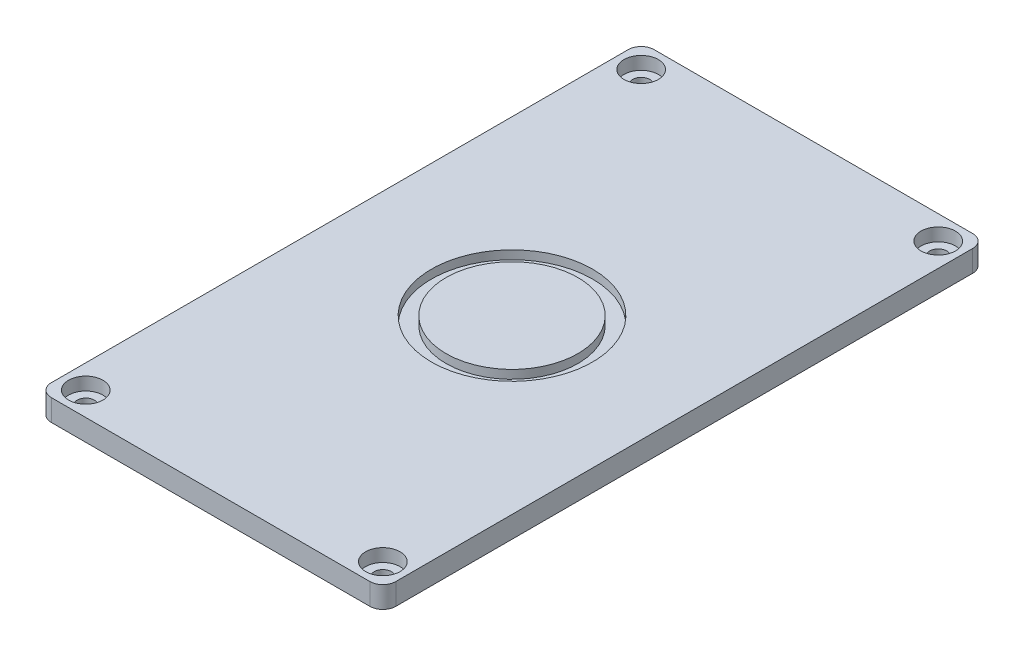
ISO-10303-21;
HEADER;
FILE_DESCRIPTION(('STEP AP214'),'2;1');
FILE_NAME('part.step','',(''),(''),'','','');
FILE_SCHEMA(('AUTOMOTIVE_DESIGN { 1 0 10303 214 1 1 1 1 }'));
ENDSEC;
DATA;
#1=APPLICATION_CONTEXT('core data for automotive mechanical design processes');
#2=APPLICATION_PROTOCOL_DEFINITION('international standard','automotive_design',2000,#1);
#3=PRODUCT_CONTEXT('',#1,'mechanical');
#4=PRODUCT('Part','Part','',(#3));
#5=PRODUCT_RELATED_PRODUCT_CATEGORY('part','',(#4));
#6=PRODUCT_DEFINITION_FORMATION('','',#4);
#7=PRODUCT_DEFINITION_CONTEXT('part definition',#1,'design');
#8=PRODUCT_DEFINITION('design','',#6,#7);
#9=PRODUCT_DEFINITION_SHAPE('','',#8);
#10=(LENGTH_UNIT() NAMED_UNIT(*) SI_UNIT(.MILLI.,.METRE.));
#11=(NAMED_UNIT(*) PLANE_ANGLE_UNIT() SI_UNIT($,.RADIAN.));
#12=(NAMED_UNIT(*) SI_UNIT($,.STERADIAN.) SOLID_ANGLE_UNIT());
#13=UNCERTAINTY_MEASURE_WITH_UNIT(LENGTH_MEASURE(1.E-05),#10,'distance_accuracy_value','');
#14=(GEOMETRIC_REPRESENTATION_CONTEXT(3) GLOBAL_UNCERTAINTY_ASSIGNED_CONTEXT((#13)) GLOBAL_UNIT_ASSIGNED_CONTEXT((#10,
#11,#12)) REPRESENTATION_CONTEXT('',''));
#15=CARTESIAN_POINT('',(0.,0.,0.));
#16=DIRECTION('',(0.,0.,1.));
#17=DIRECTION('',(1.,0.,0.));
#18=AXIS2_PLACEMENT_3D('',#15,#16,#17);
#19=CARTESIAN_POINT('',(0.,5.,0.));
#20=DIRECTION('',(1.,0.,0.));
#21=DIRECTION('',(0.,0.,-1.));
#22=AXIS2_PLACEMENT_3D('',#19,#20,#21);
#23=PLANE('',#22);
#24=DIRECTION('',(0.,0.,1.));
#25=VECTOR('',#24,1.);
#26=CARTESIAN_POINT('',(0.,5.,0.));
#27=LINE('',#26,#25);
#28=CARTESIAN_POINT('',(0.,5.,-137.));
#29=VERTEX_POINT('',#28);
#30=CARTESIAN_POINT('',(0.,5.,-3.));
#31=VERTEX_POINT('',#30);
#32=EDGE_CURVE('E134',#29,#31,#27,.T.);
#33=ORIENTED_EDGE('',*,*,#32,.F.);
#34=DIRECTION('',(0.,-1.,0.));
#35=VECTOR('',#34,1.);
#36=CARTESIAN_POINT('',(0.,5.,-137.));
#37=LINE('',#36,#35);
#38=CARTESIAN_POINT('',(0.,0.,-137.));
#39=VERTEX_POINT('',#38);
#40=EDGE_CURVE('E118',#29,#39,#37,.T.);
#41=ORIENTED_EDGE('',*,*,#40,.T.);
#42=DIRECTION('',(0.,0.,1.));
#43=VECTOR('',#42,1.);
#44=CARTESIAN_POINT('',(0.,0.,0.));
#45=LINE('',#44,#43);
#46=CARTESIAN_POINT('',(0.,0.,-3.));
#47=VERTEX_POINT('',#46);
#48=EDGE_CURVE('E131',#39,#47,#45,.T.);
#49=ORIENTED_EDGE('',*,*,#48,.T.);
#50=DIRECTION('',(0.,-1.,0.));
#51=VECTOR('',#50,1.);
#52=CARTESIAN_POINT('',(0.,5.,-3.));
#53=LINE('',#52,#51);
#54=EDGE_CURVE('E137',#47,#31,#53,.F.);
#55=ORIENTED_EDGE('',*,*,#54,.T.);
#56=EDGE_LOOP('',(#33,#41,#49,#55));
#57=FACE_BOUND('',#56,.T.);
#58=ADVANCED_FACE('F45',(#57),#23,.F.);
#59=CARTESIAN_POINT('',(0.,5.,0.));
#60=DIRECTION('',(0.,0.,-1.));
#61=DIRECTION('',(-1.,0.,0.));
#62=AXIS2_PLACEMENT_3D('',#59,#60,#61);
#63=PLANE('',#62);
#64=DIRECTION('',(1.,0.,0.));
#65=VECTOR('',#64,1.);
#66=CARTESIAN_POINT('',(0.,0.,0.));
#67=LINE('',#66,#65);
#68=CARTESIAN_POINT('',(3.,0.,0.));
#69=VERTEX_POINT('',#68);
#70=CARTESIAN_POINT('',(77.,0.,0.));
#71=VERTEX_POINT('',#70);
#72=EDGE_CURVE('E142',#69,#71,#67,.T.);
#73=ORIENTED_EDGE('',*,*,#72,.T.);
#74=DIRECTION('',(0.,-1.,0.));
#75=VECTOR('',#74,1.);
#76=CARTESIAN_POINT('',(77.,5.,0.));
#77=LINE('',#76,#75);
#78=CARTESIAN_POINT('',(77.,5.,0.));
#79=VERTEX_POINT('',#78);
#80=EDGE_CURVE('E11',#71,#79,#77,.F.);
#81=ORIENTED_EDGE('',*,*,#80,.T.);
#82=DIRECTION('',(1.,0.,0.));
#83=VECTOR('',#82,1.);
#84=CARTESIAN_POINT('',(0.,5.,0.));
#85=LINE('',#84,#83);
#86=CARTESIAN_POINT('',(3.,5.,0.));
#87=VERTEX_POINT('',#86);
#88=EDGE_CURVE('E232',#87,#79,#85,.T.);
#89=ORIENTED_EDGE('',*,*,#88,.F.);
#90=DIRECTION('',(0.,-1.,0.));
#91=VECTOR('',#90,1.);
#92=CARTESIAN_POINT('',(3.,5.,0.));
#93=LINE('',#92,#91);
#94=EDGE_CURVE('E55',#87,#69,#93,.T.);
#95=ORIENTED_EDGE('',*,*,#94,.T.);
#96=EDGE_LOOP('',(#73,#81,#89,#95));
#97=FACE_BOUND('',#96,.T.);
#98=ADVANCED_FACE('F253',(#97),#63,.F.);
#99=CARTESIAN_POINT('',(80.,5.,0.));
#100=DIRECTION('',(-1.,0.,0.));
#101=DIRECTION('',(0.,0.,1.));
#102=AXIS2_PLACEMENT_3D('',#99,#100,#101);
#103=PLANE('',#102);
#104=DIRECTION('',(0.,0.,-1.));
#105=VECTOR('',#104,1.);
#106=CARTESIAN_POINT('',(80.,0.,0.));
#107=LINE('',#106,#105);
#108=CARTESIAN_POINT('',(80.,0.,-3.));
#109=VERTEX_POINT('',#108);
#110=CARTESIAN_POINT('',(80.,0.,-137.));
#111=VERTEX_POINT('',#110);
#112=EDGE_CURVE('E148',#109,#111,#107,.T.);
#113=ORIENTED_EDGE('',*,*,#112,.T.);
#114=DIRECTION('',(0.,-1.,0.));
#115=VECTOR('',#114,1.);
#116=CARTESIAN_POINT('',(80.,5.,-137.));
#117=LINE('',#116,#115);
#118=CARTESIAN_POINT('',(80.,5.,-137.));
#119=VERTEX_POINT('',#118);
#120=EDGE_CURVE('E63',#111,#119,#117,.F.);
#121=ORIENTED_EDGE('',*,*,#120,.T.);
#122=DIRECTION('',(0.,0.,-1.));
#123=VECTOR('',#122,1.);
#124=CARTESIAN_POINT('',(80.,5.,0.));
#125=LINE('',#124,#123);
#126=CARTESIAN_POINT('',(80.,5.,-3.));
#127=VERTEX_POINT('',#126);
#128=EDGE_CURVE('E234',#127,#119,#125,.T.);
#129=ORIENTED_EDGE('',*,*,#128,.F.);
#130=DIRECTION('',(0.,-1.,0.));
#131=VECTOR('',#130,1.);
#132=CARTESIAN_POINT('',(80.,5.,-3.));
#133=LINE('',#132,#131);
#134=EDGE_CURVE('E187',#127,#109,#133,.T.);
#135=ORIENTED_EDGE('',*,*,#134,.T.);
#136=EDGE_LOOP('',(#113,#121,#129,#135));
#137=FACE_BOUND('',#136,.T.);
#138=ADVANCED_FACE('F247',(#137),#103,.F.);
#139=CARTESIAN_POINT('',(0.,5.,-140.));
#140=DIRECTION('',(0.,0.,1.));
#141=DIRECTION('',(1.,0.,0.));
#142=AXIS2_PLACEMENT_3D('',#139,#140,#141);
#143=PLANE('',#142);
#144=DIRECTION('',(-1.,0.,0.));
#145=VECTOR('',#144,1.);
#146=CARTESIAN_POINT('',(0.,0.,-140.));
#147=LINE('',#146,#145);
#148=CARTESIAN_POINT('',(77.,0.,-140.));
#149=VERTEX_POINT('',#148);
#150=CARTESIAN_POINT('',(3.,0.,-140.));
#151=VERTEX_POINT('',#150);
#152=EDGE_CURVE('E159',#149,#151,#147,.T.);
#153=ORIENTED_EDGE('',*,*,#152,.T.);
#154=DIRECTION('',(0.,-1.,0.));
#155=VECTOR('',#154,1.);
#156=CARTESIAN_POINT('',(3.,5.,-140.));
#157=LINE('',#156,#155);
#158=CARTESIAN_POINT('',(3.,5.,-140.));
#159=VERTEX_POINT('',#158);
#160=EDGE_CURVE('E119',#151,#159,#157,.F.);
#161=ORIENTED_EDGE('',*,*,#160,.T.);
#162=DIRECTION('',(-1.,0.,0.));
#163=VECTOR('',#162,1.);
#164=CARTESIAN_POINT('',(0.,5.,-140.));
#165=LINE('',#164,#163);
#166=CARTESIAN_POINT('',(77.,5.,-140.));
#167=VERTEX_POINT('',#166);
#168=EDGE_CURVE('E154',#167,#159,#165,.T.);
#169=ORIENTED_EDGE('',*,*,#168,.F.);
#170=DIRECTION('',(0.,-1.,0.));
#171=VECTOR('',#170,1.);
#172=CARTESIAN_POINT('',(77.,5.,-140.));
#173=LINE('',#172,#171);
#174=EDGE_CURVE('E125',#167,#149,#173,.T.);
#175=ORIENTED_EDGE('',*,*,#174,.T.);
#176=EDGE_LOOP('',(#153,#161,#169,#175));
#177=FACE_BOUND('',#176,.T.);
#178=ADVANCED_FACE('F243',(#177),#143,.F.);
#179=CARTESIAN_POINT('',(0.,5.,0.));
#180=DIRECTION('',(0.,-1.,0.));
#181=DIRECTION('',(0.,0.,-1.));
#182=AXIS2_PLACEMENT_3D('',#179,#180,#181);
#183=PLANE('',#182);
#184=CARTESIAN_POINT('',(40.,5.,-70.));
#185=DIRECTION('',(0.,1.,0.));
#186=DIRECTION('',(0.,0.,1.));
#187=AXIS2_PLACEMENT_3D('',#184,#185,#186);
#188=CIRCLE('',#187,18.7073249928219);
#189=CARTESIAN_POINT('',(40.,5.,-51.2926750071781));
#190=VERTEX_POINT('',#189);
#191=EDGE_CURVE('E547',#190,#190,#188,.T.);
#192=ORIENTED_EDGE('',*,*,#191,.F.);
#193=EDGE_LOOP('',(#192));
#194=FACE_BOUND('',#193,.T.);
#195=CARTESIAN_POINT('',(5.5,5.,-134.5));
#196=DIRECTION('',(0.,1.,0.));
#197=DIRECTION('',(0.,0.,-1.));
#198=AXIS2_PLACEMENT_3D('',#195,#196,#197);
#199=CIRCLE('',#198,4.);
#200=CARTESIAN_POINT('',(5.5,5.,-138.5));
#201=VERTEX_POINT('',#200);
#202=EDGE_CURVE('E216',#201,#201,#199,.T.);
#203=ORIENTED_EDGE('',*,*,#202,.F.);
#204=EDGE_LOOP('',(#203));
#205=FACE_BOUND('',#204,.T.);
#206=CARTESIAN_POINT('',(74.5,5.,-134.5));
#207=DIRECTION('',(0.,1.,0.));
#208=DIRECTION('',(0.,0.,1.));
#209=AXIS2_PLACEMENT_3D('',#206,#207,#208);
#210=CIRCLE('',#209,4.00000000000001);
#211=CARTESIAN_POINT('',(74.5,5.,-130.5));
#212=VERTEX_POINT('',#211);
#213=EDGE_CURVE('E521',#212,#212,#210,.T.);
#214=ORIENTED_EDGE('',*,*,#213,.F.);
#215=EDGE_LOOP('',(#214));
#216=FACE_BOUND('',#215,.T.);
#217=CARTESIAN_POINT('',(74.5,5.,-5.50000000000001));
#218=DIRECTION('',(0.,1.,0.));
#219=DIRECTION('',(0.,0.,-1.));
#220=AXIS2_PLACEMENT_3D('',#217,#218,#219);
#221=CIRCLE('',#220,4.00000000000001);
#222=CARTESIAN_POINT('',(74.5,5.,-9.50000000000001));
#223=VERTEX_POINT('',#222);
#224=EDGE_CURVE('E229',#223,#223,#221,.T.);
#225=ORIENTED_EDGE('',*,*,#224,.F.);
#226=EDGE_LOOP('',(#225));
#227=FACE_BOUND('',#226,.T.);
#228=CARTESIAN_POINT('',(5.5,5.,-5.50000000000001));
#229=DIRECTION('',(0.,1.,0.));
#230=DIRECTION('',(0.,0.,1.));
#231=AXIS2_PLACEMENT_3D('',#228,#229,#230);
#232=CIRCLE('',#231,4.);
#233=CARTESIAN_POINT('',(5.5,5.,-1.5));
#234=VERTEX_POINT('',#233);
#235=EDGE_CURVE('E151',#234,#234,#232,.T.);
#236=ORIENTED_EDGE('',*,*,#235,.F.);
#237=EDGE_LOOP('',(#236));
#238=FACE_BOUND('',#237,.T.);
#239=ORIENTED_EDGE('',*,*,#168,.T.);
#240=CARTESIAN_POINT('',(3.,5.,-137.));
#241=DIRECTION('',(0.,-1.,0.));
#242=DIRECTION('',(0.,0.,-1.));
#243=AXIS2_PLACEMENT_3D('',#240,#241,#242);
#244=CIRCLE('',#243,3.);
#245=EDGE_CURVE('E184',#159,#29,#244,.F.);
#246=ORIENTED_EDGE('',*,*,#245,.T.);
#247=ORIENTED_EDGE('',*,*,#32,.T.);
#248=CARTESIAN_POINT('',(3.,5.,-3.));
#249=DIRECTION('',(0.,-1.,0.));
#250=DIRECTION('',(0.,0.,-1.));
#251=AXIS2_PLACEMENT_3D('',#248,#249,#250);
#252=CIRCLE('',#251,3.);
#253=EDGE_CURVE('E176',#31,#87,#252,.F.);
#254=ORIENTED_EDGE('',*,*,#253,.T.);
#255=ORIENTED_EDGE('',*,*,#88,.T.);
#256=CARTESIAN_POINT('',(77.,5.,-3.));
#257=DIRECTION('',(0.,-1.,0.));
#258=DIRECTION('',(0.,0.,-1.));
#259=AXIS2_PLACEMENT_3D('',#256,#257,#258);
#260=CIRCLE('',#259,3.);
#261=EDGE_CURVE('E70',#79,#127,#260,.F.);
#262=ORIENTED_EDGE('',*,*,#261,.T.);
#263=ORIENTED_EDGE('',*,*,#128,.T.);
#264=CARTESIAN_POINT('',(77.,5.,-137.));
#265=DIRECTION('',(0.,-1.,0.));
#266=DIRECTION('',(0.,0.,-1.));
#267=AXIS2_PLACEMENT_3D('',#264,#265,#266);
#268=CIRCLE('',#267,3.);
#269=EDGE_CURVE('E181',#119,#167,#268,.F.);
#270=ORIENTED_EDGE('',*,*,#269,.T.);
#271=EDGE_LOOP('',(#239,#246,#247,#254,#255,#262,#263,#270));
#272=FACE_BOUND('',#271,.T.);
#273=ADVANCED_FACE('F240',(#194,#205,#216,#227,#238,#272),#183,.F.);
#274=CARTESIAN_POINT('',(0.,0.,0.));
#275=DIRECTION('',(0.,-1.,0.));
#276=DIRECTION('',(0.,0.,-1.));
#277=AXIS2_PLACEMENT_3D('',#274,#275,#276);
#278=PLANE('',#277);
#279=CARTESIAN_POINT('',(5.5,0.,-134.5));
#280=DIRECTION('',(0.,-1.,0.));
#281=DIRECTION('',(0.,0.,-1.));
#282=AXIS2_PLACEMENT_3D('',#279,#280,#281);
#283=CIRCLE('',#282,2.);
#284=CARTESIAN_POINT('',(5.5,0.,-136.5));
#285=VERTEX_POINT('',#284);
#286=EDGE_CURVE('E49',#285,#285,#283,.T.);
#287=ORIENTED_EDGE('',*,*,#286,.F.);
#288=EDGE_LOOP('',(#287));
#289=FACE_BOUND('',#288,.T.);
#290=CARTESIAN_POINT('',(74.5,0.,-5.50000000000001));
#291=DIRECTION('',(0.,-1.,0.));
#292=DIRECTION('',(0.,0.,-1.));
#293=AXIS2_PLACEMENT_3D('',#290,#291,#292);
#294=CIRCLE('',#293,2.00000000000001);
#295=CARTESIAN_POINT('',(74.5,0.,-7.50000000000001));
#296=VERTEX_POINT('',#295);
#297=EDGE_CURVE('E204',#296,#296,#294,.T.);
#298=ORIENTED_EDGE('',*,*,#297,.F.);
#299=EDGE_LOOP('',(#298));
#300=FACE_BOUND('',#299,.T.);
#301=CARTESIAN_POINT('',(74.5,0.,-134.5));
#302=DIRECTION('',(0.,-1.,0.));
#303=DIRECTION('',(0.,0.,-1.));
#304=AXIS2_PLACEMENT_3D('',#301,#302,#303);
#305=CIRCLE('',#304,1.99999999999998);
#306=CARTESIAN_POINT('',(74.5,0.,-136.5));
#307=VERTEX_POINT('',#306);
#308=EDGE_CURVE('E200',#307,#307,#305,.T.);
#309=ORIENTED_EDGE('',*,*,#308,.F.);
#310=EDGE_LOOP('',(#309));
#311=FACE_BOUND('',#310,.T.);
#312=CARTESIAN_POINT('',(5.5,0.,-5.50000000000001));
#313=DIRECTION('',(0.,-1.,0.));
#314=DIRECTION('',(0.,0.,-1.));
#315=AXIS2_PLACEMENT_3D('',#312,#313,#314);
#316=CIRCLE('',#315,2.);
#317=CARTESIAN_POINT('',(5.5,0.,-7.50000000000001));
#318=VERTEX_POINT('',#317);
#319=EDGE_CURVE('E196',#318,#318,#316,.T.);
#320=ORIENTED_EDGE('',*,*,#319,.F.);
#321=EDGE_LOOP('',(#320));
#322=FACE_BOUND('',#321,.T.);
#323=ORIENTED_EDGE('',*,*,#48,.F.);
#324=CARTESIAN_POINT('',(3.,0.,-137.));
#325=DIRECTION('',(0.,-1.,0.));
#326=DIRECTION('',(0.,0.,-1.));
#327=AXIS2_PLACEMENT_3D('',#324,#325,#326);
#328=CIRCLE('',#327,3.);
#329=EDGE_CURVE('E114',#39,#151,#328,.T.);
#330=ORIENTED_EDGE('',*,*,#329,.T.);
#331=ORIENTED_EDGE('',*,*,#152,.F.);
#332=CARTESIAN_POINT('',(77.,0.,-137.));
#333=DIRECTION('',(0.,-1.,0.));
#334=DIRECTION('',(0.,0.,-1.));
#335=AXIS2_PLACEMENT_3D('',#332,#333,#334);
#336=CIRCLE('',#335,3.);
#337=EDGE_CURVE('E126',#149,#111,#336,.T.);
#338=ORIENTED_EDGE('',*,*,#337,.T.);
#339=ORIENTED_EDGE('',*,*,#112,.F.);
#340=CARTESIAN_POINT('',(77.,0.,-3.));
#341=DIRECTION('',(0.,-1.,0.));
#342=DIRECTION('',(0.,0.,-1.));
#343=AXIS2_PLACEMENT_3D('',#340,#341,#342);
#344=CIRCLE('',#343,3.);
#345=EDGE_CURVE('E166',#109,#71,#344,.T.);
#346=ORIENTED_EDGE('',*,*,#345,.T.);
#347=ORIENTED_EDGE('',*,*,#72,.F.);
#348=CARTESIAN_POINT('',(3.,0.,-3.));
#349=DIRECTION('',(0.,-1.,0.));
#350=DIRECTION('',(0.,0.,-1.));
#351=AXIS2_PLACEMENT_3D('',#348,#349,#350);
#352=CIRCLE('',#351,3.);
#353=EDGE_CURVE('E136',#69,#47,#352,.T.);
#354=ORIENTED_EDGE('',*,*,#353,.T.);
#355=EDGE_LOOP('',(#323,#330,#331,#338,#339,#346,#347,#354));
#356=FACE_BOUND('',#355,.T.);
#357=ADVANCED_FACE('F139',(#289,#300,#311,#322,#356),#278,.T.);
#358=CARTESIAN_POINT('',(3.,5.,-137.));
#359=DIRECTION('',(0.,-1.,0.));
#360=DIRECTION('',(0.,0.,-1.));
#361=AXIS2_PLACEMENT_3D('',#358,#359,#360);
#362=CYLINDRICAL_SURFACE('',#361,3.);
#363=ORIENTED_EDGE('',*,*,#245,.F.);
#364=ORIENTED_EDGE('',*,*,#160,.F.);
#365=ORIENTED_EDGE('',*,*,#329,.F.);
#366=ORIENTED_EDGE('',*,*,#40,.F.);
#367=EDGE_LOOP('',(#363,#364,#365,#366));
#368=FACE_BOUND('',#367,.T.);
#369=ADVANCED_FACE('F117',(#368),#362,.T.);
#370=CARTESIAN_POINT('',(77.,5.,-137.));
#371=DIRECTION('',(0.,-1.,0.));
#372=DIRECTION('',(0.,0.,-1.));
#373=AXIS2_PLACEMENT_3D('',#370,#371,#372);
#374=CYLINDRICAL_SURFACE('',#373,3.);
#375=ORIENTED_EDGE('',*,*,#269,.F.);
#376=ORIENTED_EDGE('',*,*,#120,.F.);
#377=ORIENTED_EDGE('',*,*,#337,.F.);
#378=ORIENTED_EDGE('',*,*,#174,.F.);
#379=EDGE_LOOP('',(#375,#376,#377,#378));
#380=FACE_BOUND('',#379,.T.);
#381=ADVANCED_FACE('F245',(#380),#374,.T.);
#382=CARTESIAN_POINT('',(77.,5.,-3.));
#383=DIRECTION('',(0.,-1.,0.));
#384=DIRECTION('',(0.,0.,-1.));
#385=AXIS2_PLACEMENT_3D('',#382,#383,#384);
#386=CYLINDRICAL_SURFACE('',#385,3.);
#387=ORIENTED_EDGE('',*,*,#261,.F.);
#388=ORIENTED_EDGE('',*,*,#80,.F.);
#389=ORIENTED_EDGE('',*,*,#345,.F.);
#390=ORIENTED_EDGE('',*,*,#134,.F.);
#391=EDGE_LOOP('',(#387,#388,#389,#390));
#392=FACE_BOUND('',#391,.T.);
#393=ADVANCED_FACE('F250',(#392),#386,.T.);
#394=CARTESIAN_POINT('',(3.,5.,-3.));
#395=DIRECTION('',(0.,-1.,0.));
#396=DIRECTION('',(0.,0.,-1.));
#397=AXIS2_PLACEMENT_3D('',#394,#395,#396);
#398=CYLINDRICAL_SURFACE('',#397,3.);
#399=ORIENTED_EDGE('',*,*,#253,.F.);
#400=ORIENTED_EDGE('',*,*,#54,.F.);
#401=ORIENTED_EDGE('',*,*,#353,.F.);
#402=ORIENTED_EDGE('',*,*,#94,.F.);
#403=EDGE_LOOP('',(#399,#400,#401,#402));
#404=FACE_BOUND('',#403,.T.);
#405=ADVANCED_FACE('F47',(#404),#398,.T.);
#406=CARTESIAN_POINT('',(5.5,2.,-5.50000000000001));
#407=DIRECTION('',(0.,1.,0.));
#408=DIRECTION('',(0.,0.,1.));
#409=AXIS2_PLACEMENT_3D('',#406,#407,#408);
#410=CYLINDRICAL_SURFACE('',#409,4.);
#411=CARTESIAN_POINT('',(5.5,2.,-5.50000000000001));
#412=DIRECTION('',(0.,1.,0.));
#413=DIRECTION('',(0.,0.,1.));
#414=AXIS2_PLACEMENT_3D('',#411,#412,#413);
#415=CIRCLE('',#414,4.);
#416=CARTESIAN_POINT('',(5.5,2.,-1.5));
#417=VERTEX_POINT('',#416);
#418=EDGE_CURVE('E143',#417,#417,#415,.T.);
#419=ORIENTED_EDGE('',*,*,#418,.F.);
#420=EDGE_LOOP('',(#419));
#421=FACE_BOUND('',#420,.T.);
#422=ORIENTED_EDGE('',*,*,#235,.T.);
#423=EDGE_LOOP('',(#422));
#424=FACE_BOUND('',#423,.T.);
#425=ADVANCED_FACE('F259',(#421,#424),#410,.F.);
#426=CARTESIAN_POINT('',(5.5,2.,-5.50000000000001));
#427=DIRECTION('',(0.,1.,0.));
#428=DIRECTION('',(0.,0.,1.));
#429=AXIS2_PLACEMENT_3D('',#426,#427,#428);
#430=PLANE('',#429);
#431=CARTESIAN_POINT('',(5.5,2.,-5.50000000000001));
#432=DIRECTION('',(0.,1.,0.));
#433=DIRECTION('',(0.,0.,1.));
#434=AXIS2_PLACEMENT_3D('',#431,#432,#433);
#435=CIRCLE('',#434,2.);
#436=CARTESIAN_POINT('',(5.5,2.,-3.5));
#437=VERTEX_POINT('',#436);
#438=EDGE_CURVE('E201',#437,#437,#435,.T.);
#439=ORIENTED_EDGE('',*,*,#438,.F.);
#440=EDGE_LOOP('',(#439));
#441=FACE_BOUND('',#440,.T.);
#442=ORIENTED_EDGE('',*,*,#418,.T.);
#443=EDGE_LOOP('',(#442));
#444=FACE_BOUND('',#443,.T.);
#445=ADVANCED_FACE('F264',(#441,#444),#430,.T.);
#446=CARTESIAN_POINT('',(74.5,2.,-5.50000000000001));
#447=DIRECTION('',(0.,1.,0.));
#448=DIRECTION('',(0.,0.,1.));
#449=AXIS2_PLACEMENT_3D('',#446,#447,#448);
#450=CYLINDRICAL_SURFACE('',#449,4.00000000000001);
#451=CARTESIAN_POINT('',(74.5,2.,-5.50000000000001));
#452=DIRECTION('',(0.,1.,0.));
#453=DIRECTION('',(0.,0.,-1.));
#454=AXIS2_PLACEMENT_3D('',#451,#452,#453);
#455=CIRCLE('',#454,4.00000000000001);
#456=CARTESIAN_POINT('',(74.5,2.,-9.50000000000001));
#457=VERTEX_POINT('',#456);
#458=EDGE_CURVE('E517',#457,#457,#455,.T.);
#459=ORIENTED_EDGE('',*,*,#458,.F.);
#460=EDGE_LOOP('',(#459));
#461=FACE_BOUND('',#460,.T.);
#462=ORIENTED_EDGE('',*,*,#224,.T.);
#463=EDGE_LOOP('',(#462));
#464=FACE_BOUND('',#463,.T.);
#465=ADVANCED_FACE('F309',(#461,#464),#450,.F.);
#466=CARTESIAN_POINT('',(74.5,2.,-5.50000000000001));
#467=DIRECTION('',(0.,-1.,0.));
#468=DIRECTION('',(0.,0.,-1.));
#469=AXIS2_PLACEMENT_3D('',#466,#467,#468);
#470=PLANE('',#469);
#471=CARTESIAN_POINT('',(74.5,2.,-5.50000000000001));
#472=DIRECTION('',(0.,1.,0.));
#473=DIRECTION('',(0.,0.,-1.));
#474=AXIS2_PLACEMENT_3D('',#471,#472,#473);
#475=CIRCLE('',#474,2.00000000000001);
#476=CARTESIAN_POINT('',(74.5,2.,-7.50000000000001));
#477=VERTEX_POINT('',#476);
#478=EDGE_CURVE('E510',#477,#477,#475,.T.);
#479=ORIENTED_EDGE('',*,*,#478,.F.);
#480=EDGE_LOOP('',(#479));
#481=FACE_BOUND('',#480,.T.);
#482=ORIENTED_EDGE('',*,*,#458,.T.);
#483=EDGE_LOOP('',(#482));
#484=FACE_BOUND('',#483,.T.);
#485=ADVANCED_FACE('F320',(#481,#484),#470,.F.);
#486=CARTESIAN_POINT('',(74.5,2.,-134.5));
#487=DIRECTION('',(0.,1.,0.));
#488=DIRECTION('',(0.,0.,1.));
#489=AXIS2_PLACEMENT_3D('',#486,#487,#488);
#490=CYLINDRICAL_SURFACE('',#489,4.00000000000001);
#491=CARTESIAN_POINT('',(74.5,2.,-134.5));
#492=DIRECTION('',(0.,1.,0.));
#493=DIRECTION('',(0.,0.,1.));
#494=AXIS2_PLACEMENT_3D('',#491,#492,#493);
#495=CIRCLE('',#494,4.00000000000001);
#496=CARTESIAN_POINT('',(74.5,2.,-130.5));
#497=VERTEX_POINT('',#496);
#498=EDGE_CURVE('E222',#497,#497,#495,.T.);
#499=ORIENTED_EDGE('',*,*,#498,.F.);
#500=EDGE_LOOP('',(#499));
#501=FACE_BOUND('',#500,.T.);
#502=ORIENTED_EDGE('',*,*,#213,.T.);
#503=EDGE_LOOP('',(#502));
#504=FACE_BOUND('',#503,.T.);
#505=ADVANCED_FACE('F330',(#501,#504),#490,.F.);
#506=CARTESIAN_POINT('',(74.5,2.,-134.5));
#507=DIRECTION('',(0.,1.,0.));
#508=DIRECTION('',(0.,0.,1.));
#509=AXIS2_PLACEMENT_3D('',#506,#507,#508);
#510=PLANE('',#509);
#511=CARTESIAN_POINT('',(74.5,2.,-134.5));
#512=DIRECTION('',(0.,1.,0.));
#513=DIRECTION('',(0.,0.,1.));
#514=AXIS2_PLACEMENT_3D('',#511,#512,#513);
#515=CIRCLE('',#514,1.99999999999998);
#516=CARTESIAN_POINT('',(74.5,2.,-132.5));
#517=VERTEX_POINT('',#516);
#518=EDGE_CURVE('E541',#517,#517,#515,.T.);
#519=ORIENTED_EDGE('',*,*,#518,.F.);
#520=EDGE_LOOP('',(#519));
#521=FACE_BOUND('',#520,.T.);
#522=ORIENTED_EDGE('',*,*,#498,.T.);
#523=EDGE_LOOP('',(#522));
#524=FACE_BOUND('',#523,.T.);
#525=ADVANCED_FACE('F340',(#521,#524),#510,.T.);
#526=CARTESIAN_POINT('',(5.5,2.,-134.5));
#527=DIRECTION('',(0.,1.,0.));
#528=DIRECTION('',(0.,0.,1.));
#529=AXIS2_PLACEMENT_3D('',#526,#527,#528);
#530=CYLINDRICAL_SURFACE('',#529,4.);
#531=CARTESIAN_POINT('',(5.5,2.,-134.5));
#532=DIRECTION('',(0.,1.,0.));
#533=DIRECTION('',(0.,0.,-1.));
#534=AXIS2_PLACEMENT_3D('',#531,#532,#533);
#535=CIRCLE('',#534,4.);
#536=CARTESIAN_POINT('',(5.5,2.,-138.5));
#537=VERTEX_POINT('',#536);
#538=EDGE_CURVE('E211',#537,#537,#535,.T.);
#539=ORIENTED_EDGE('',*,*,#538,.F.);
#540=EDGE_LOOP('',(#539));
#541=FACE_BOUND('',#540,.T.);
#542=ORIENTED_EDGE('',*,*,#202,.T.);
#543=EDGE_LOOP('',(#542));
#544=FACE_BOUND('',#543,.T.);
#545=ADVANCED_FACE('F350',(#541,#544),#530,.F.);
#546=CARTESIAN_POINT('',(5.5,2.,-134.5));
#547=DIRECTION('',(0.,-1.,0.));
#548=DIRECTION('',(0.,0.,-1.));
#549=AXIS2_PLACEMENT_3D('',#546,#547,#548);
#550=PLANE('',#549);
#551=CARTESIAN_POINT('',(5.5,2.,-134.5));
#552=DIRECTION('',(0.,1.,0.));
#553=DIRECTION('',(0.,0.,-1.));
#554=AXIS2_PLACEMENT_3D('',#551,#552,#553);
#555=CIRCLE('',#554,2.);
#556=CARTESIAN_POINT('',(5.5,2.,-136.5));
#557=VERTEX_POINT('',#556);
#558=EDGE_CURVE('E506',#557,#557,#555,.T.);
#559=ORIENTED_EDGE('',*,*,#558,.F.);
#560=EDGE_LOOP('',(#559));
#561=FACE_BOUND('',#560,.T.);
#562=ORIENTED_EDGE('',*,*,#538,.T.);
#563=EDGE_LOOP('',(#562));
#564=FACE_BOUND('',#563,.T.);
#565=ADVANCED_FACE('F360',(#561,#564),#550,.F.);
#566=CARTESIAN_POINT('',(5.5,-1.,-5.50000000000001));
#567=DIRECTION('',(0.,1.,0.));
#568=DIRECTION('',(0.,0.,1.));
#569=AXIS2_PLACEMENT_3D('',#566,#567,#568);
#570=CYLINDRICAL_SURFACE('',#569,2.);
#571=ORIENTED_EDGE('',*,*,#319,.T.);
#572=EDGE_LOOP('',(#571));
#573=FACE_BOUND('',#572,.T.);
#574=ORIENTED_EDGE('',*,*,#438,.T.);
#575=EDGE_LOOP('',(#574));
#576=FACE_BOUND('',#575,.T.);
#577=ADVANCED_FACE('F369',(#573,#576),#570,.F.);
#578=CARTESIAN_POINT('',(74.5,-1.,-134.5));
#579=DIRECTION('',(0.,1.,0.));
#580=DIRECTION('',(0.,0.,1.));
#581=AXIS2_PLACEMENT_3D('',#578,#579,#580);
#582=CYLINDRICAL_SURFACE('',#581,1.99999999999998);
#583=ORIENTED_EDGE('',*,*,#308,.T.);
#584=EDGE_LOOP('',(#583));
#585=FACE_BOUND('',#584,.T.);
#586=ORIENTED_EDGE('',*,*,#518,.T.);
#587=EDGE_LOOP('',(#586));
#588=FACE_BOUND('',#587,.T.);
#589=ADVANCED_FACE('F379',(#585,#588),#582,.F.);
#590=CARTESIAN_POINT('',(74.5,-1.,-5.50000000000001));
#591=DIRECTION('',(0.,1.,0.));
#592=DIRECTION('',(0.,0.,1.));
#593=AXIS2_PLACEMENT_3D('',#590,#591,#592);
#594=CYLINDRICAL_SURFACE('',#593,2.00000000000001);
#595=ORIENTED_EDGE('',*,*,#297,.T.);
#596=EDGE_LOOP('',(#595));
#597=FACE_BOUND('',#596,.T.);
#598=ORIENTED_EDGE('',*,*,#478,.T.);
#599=EDGE_LOOP('',(#598));
#600=FACE_BOUND('',#599,.T.);
#601=ADVANCED_FACE('F389',(#597,#600),#594,.F.);
#602=CARTESIAN_POINT('',(5.5,-1.,-134.5));
#603=DIRECTION('',(0.,1.,0.));
#604=DIRECTION('',(0.,0.,1.));
#605=AXIS2_PLACEMENT_3D('',#602,#603,#604);
#606=CYLINDRICAL_SURFACE('',#605,2.);
#607=ORIENTED_EDGE('',*,*,#286,.T.);
#608=EDGE_LOOP('',(#607));
#609=FACE_BOUND('',#608,.T.);
#610=ORIENTED_EDGE('',*,*,#558,.T.);
#611=EDGE_LOOP('',(#610));
#612=FACE_BOUND('',#611,.T.);
#613=ADVANCED_FACE('F399',(#609,#612),#606,.F.);
#614=CARTESIAN_POINT('',(40.,3.,-70.));
#615=DIRECTION('',(0.,1.,0.));
#616=DIRECTION('',(0.,0.,1.));
#617=AXIS2_PLACEMENT_3D('',#614,#615,#616);
#618=CYLINDRICAL_SURFACE('',#617,18.7073249928219);
#619=CARTESIAN_POINT('',(40.,3.,-70.));
#620=DIRECTION('',(0.,1.,0.));
#621=DIRECTION('',(0.,0.,1.));
#622=AXIS2_PLACEMENT_3D('',#619,#620,#621);
#623=CIRCLE('',#622,18.7073249928219);
#624=CARTESIAN_POINT('',(40.,3.,-51.2926750071781));
#625=VERTEX_POINT('',#624);
#626=EDGE_CURVE('E546',#625,#625,#623,.T.);
#627=ORIENTED_EDGE('',*,*,#626,.F.);
#628=EDGE_LOOP('',(#627));
#629=FACE_BOUND('',#628,.T.);
#630=ORIENTED_EDGE('',*,*,#191,.T.);
#631=EDGE_LOOP('',(#630));
#632=FACE_BOUND('',#631,.T.);
#633=ADVANCED_FACE('F408',(#629,#632),#618,.F.);
#634=CARTESIAN_POINT('',(40.,3.,-70.));
#635=DIRECTION('',(0.,1.,0.));
#636=DIRECTION('',(0.,0.,1.));
#637=AXIS2_PLACEMENT_3D('',#634,#635,#636);
#638=PLANE('',#637);
#639=CARTESIAN_POINT('',(40.,3.,-70.));
#640=DIRECTION('',(0.,1.,0.));
#641=DIRECTION('',(0.,0.,1.));
#642=AXIS2_PLACEMENT_3D('',#639,#640,#641);
#643=CIRCLE('',#642,15.3130802815712);
#644=CARTESIAN_POINT('',(40.,3.,-54.6869197184288));
#645=VERTEX_POINT('',#644);
#646=EDGE_CURVE('E551',#645,#645,#643,.T.);
#647=ORIENTED_EDGE('',*,*,#646,.F.);
#648=EDGE_LOOP('',(#647));
#649=FACE_BOUND('',#648,.T.);
#650=ORIENTED_EDGE('',*,*,#626,.T.);
#651=EDGE_LOOP('',(#650));
#652=FACE_BOUND('',#651,.T.);
#653=ADVANCED_FACE('F428',(#649,#652),#638,.T.);
#654=CARTESIAN_POINT('',(40.,3.,-70.));
#655=DIRECTION('',(0.,1.,0.));
#656=DIRECTION('',(0.,0.,1.));
#657=AXIS2_PLACEMENT_3D('',#654,#655,#656);
#658=CYLINDRICAL_SURFACE('',#657,15.3130802815712);
#659=ORIENTED_EDGE('',*,*,#646,.T.);
#660=EDGE_LOOP('',(#659));
#661=FACE_BOUND('',#660,.T.);
#662=CARTESIAN_POINT('',(40.,5.,-70.));
#663=DIRECTION('',(0.,1.,0.));
#664=DIRECTION('',(0.,0.,1.));
#665=AXIS2_PLACEMENT_3D('',#662,#663,#664);
#666=CIRCLE('',#665,15.3130802815712);
#667=CARTESIAN_POINT('',(40.,5.,-54.6869197184288));
#668=VERTEX_POINT('',#667);
#669=EDGE_CURVE('E555',#668,#668,#666,.T.);
#670=ORIENTED_EDGE('',*,*,#669,.F.);
#671=EDGE_LOOP('',(#670));
#672=FACE_BOUND('',#671,.T.);
#673=ADVANCED_FACE('F419',(#661,#672),#658,.T.);
#674=ORIENTED_EDGE('',*,*,#669,.T.);
#675=EDGE_LOOP('',(#674));
#676=FACE_BOUND('',#675,.T.);
#677=ADVANCED_FACE('F414',(#676),#183,.F.);
#678=CLOSED_SHELL('',(#58,#98,#138,#178,#273,#357,#369,#381,#393,#405,#425,#445,#465,#485,#505,
#525,#545,#565,#577,#589,#601,#613,#633,#653,#673,#677));
#679=MANIFOLD_SOLID_BREP('B2',#678);
#680=ADVANCED_BREP_SHAPE_REPRESENTATION('',(#18,#679),#14);
#681=SHAPE_DEFINITION_REPRESENTATION(#9,#680);
ENDSEC;
END-ISO-10303-21;
